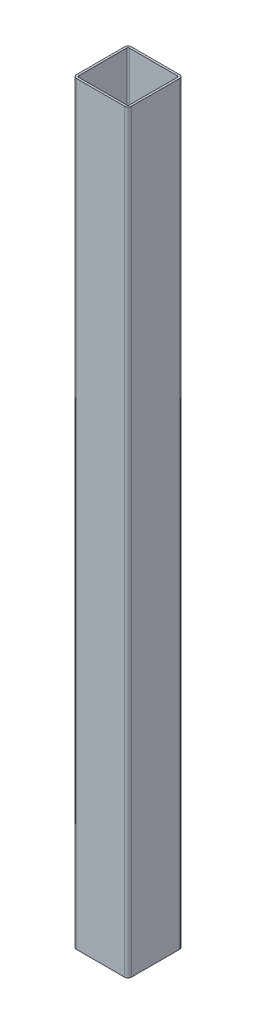
ISO-10303-21;
HEADER;
FILE_DESCRIPTION(('STEP AP214'),'2;1');
FILE_NAME('part.step','',(''),(''),'','','');
FILE_SCHEMA(('AUTOMOTIVE_DESIGN { 1 0 10303 214 1 1 1 1 }'));
ENDSEC;
DATA;
#1=APPLICATION_CONTEXT('core data for automotive mechanical design processes');
#2=APPLICATION_PROTOCOL_DEFINITION('international standard','automotive_design',2000,#1);
#3=PRODUCT_CONTEXT('',#1,'mechanical');
#4=PRODUCT('Part','Part','',(#3));
#5=PRODUCT_RELATED_PRODUCT_CATEGORY('part','',(#4));
#6=PRODUCT_DEFINITION_FORMATION('','',#4);
#7=PRODUCT_DEFINITION_CONTEXT('part definition',#1,'design');
#8=PRODUCT_DEFINITION('design','',#6,#7);
#9=PRODUCT_DEFINITION_SHAPE('','',#8);
#10=(LENGTH_UNIT() NAMED_UNIT(*) SI_UNIT(.MILLI.,.METRE.));
#11=(NAMED_UNIT(*) PLANE_ANGLE_UNIT() SI_UNIT($,.RADIAN.));
#12=(NAMED_UNIT(*) SI_UNIT($,.STERADIAN.) SOLID_ANGLE_UNIT());
#13=UNCERTAINTY_MEASURE_WITH_UNIT(LENGTH_MEASURE(1.E-05),#10,'distance_accuracy_value','');
#14=(GEOMETRIC_REPRESENTATION_CONTEXT(3) GLOBAL_UNCERTAINTY_ASSIGNED_CONTEXT((#13)) GLOBAL_UNIT_ASSIGNED_CONTEXT((#10,
#11,#12)) REPRESENTATION_CONTEXT('',''));
#15=CARTESIAN_POINT('',(0.,0.,0.));
#16=DIRECTION('',(0.,0.,1.));
#17=DIRECTION('',(1.,0.,0.));
#18=AXIS2_PLACEMENT_3D('',#15,#16,#17);
#19=CARTESIAN_POINT('',(-35.,1100.,35.));
#20=DIRECTION('',(0.,1.,0.));
#21=DIRECTION('',(0.,0.,1.));
#22=AXIS2_PLACEMENT_3D('',#19,#20,#21);
#23=PLANE('',#22);
#24=CARTESIAN_POINT('',(-35.,1100.,35.));
#25=DIRECTION('',(0.,1.,0.));
#26=DIRECTION('',(0.,0.,1.));
#27=AXIS2_PLACEMENT_3D('',#24,#25,#26);
#28=CIRCLE('',#27,5.);
#29=CARTESIAN_POINT('',(-40.,1100.,35.));
#30=VERTEX_POINT('',#29);
#31=CARTESIAN_POINT('',(-35.,1100.,40.));
#32=VERTEX_POINT('',#31);
#33=EDGE_CURVE('E261',#30,#32,#28,.T.);
#34=ORIENTED_EDGE('',*,*,#33,.T.);
#35=DIRECTION('',(1.,0.,0.));
#36=VECTOR('',#35,1.);
#37=CARTESIAN_POINT('',(-35.,1100.,40.));
#38=LINE('',#37,#36);
#39=CARTESIAN_POINT('',(35.,1100.,40.));
#40=VERTEX_POINT('',#39);
#41=EDGE_CURVE('E264',#32,#40,#38,.T.);
#42=ORIENTED_EDGE('',*,*,#41,.T.);
#43=CARTESIAN_POINT('',(35.,1100.,35.));
#44=DIRECTION('',(0.,1.,0.));
#45=DIRECTION('',(0.,0.,1.));
#46=AXIS2_PLACEMENT_3D('',#43,#44,#45);
#47=CIRCLE('',#46,5.);
#48=CARTESIAN_POINT('',(40.,1100.,35.));
#49=VERTEX_POINT('',#48);
#50=EDGE_CURVE('E267',#40,#49,#47,.T.);
#51=ORIENTED_EDGE('',*,*,#50,.T.);
#52=DIRECTION('',(0.,0.,-1.));
#53=VECTOR('',#52,1.);
#54=CARTESIAN_POINT('',(40.,1100.,-35.));
#55=LINE('',#54,#53);
#56=CARTESIAN_POINT('',(40.,1100.,-35.));
#57=VERTEX_POINT('',#56);
#58=EDGE_CURVE('E269',#49,#57,#55,.T.);
#59=ORIENTED_EDGE('',*,*,#58,.T.);
#60=CARTESIAN_POINT('',(35.,1100.,-35.));
#61=DIRECTION('',(0.,1.,0.));
#62=DIRECTION('',(0.,0.,-1.));
#63=AXIS2_PLACEMENT_3D('',#60,#61,#62);
#64=CIRCLE('',#63,5.);
#65=CARTESIAN_POINT('',(35.,1100.,-40.));
#66=VERTEX_POINT('',#65);
#67=EDGE_CURVE('E271',#57,#66,#64,.T.);
#68=ORIENTED_EDGE('',*,*,#67,.T.);
#69=DIRECTION('',(-1.,0.,0.));
#70=VECTOR('',#69,1.);
#71=CARTESIAN_POINT('',(-35.,1100.,-40.));
#72=LINE('',#71,#70);
#73=CARTESIAN_POINT('',(-35.,1100.,-40.));
#74=VERTEX_POINT('',#73);
#75=EDGE_CURVE('E273',#66,#74,#72,.T.);
#76=ORIENTED_EDGE('',*,*,#75,.T.);
#77=CARTESIAN_POINT('',(-35.,1100.,-35.));
#78=DIRECTION('',(0.,1.,0.));
#79=DIRECTION('',(0.,0.,1.));
#80=AXIS2_PLACEMENT_3D('',#77,#78,#79);
#81=CIRCLE('',#80,5.);
#82=CARTESIAN_POINT('',(-40.,1100.,-35.));
#83=VERTEX_POINT('',#82);
#84=EDGE_CURVE('E275',#74,#83,#81,.T.);
#85=ORIENTED_EDGE('',*,*,#84,.T.);
#86=DIRECTION('',(0.,0.,1.));
#87=VECTOR('',#86,1.);
#88=CARTESIAN_POINT('',(-40.,1100.,-35.));
#89=LINE('',#88,#87);
#90=EDGE_CURVE('E277',#83,#30,#89,.T.);
#91=ORIENTED_EDGE('',*,*,#90,.T.);
#92=EDGE_LOOP('',(#34,#42,#51,#59,#68,#76,#85,#91));
#93=FACE_BOUND('',#92,.T.);
#94=DIRECTION('',(1.,0.,0.));
#95=VECTOR('',#94,1.);
#96=CARTESIAN_POINT('',(-35.,1100.,37.));
#97=LINE('',#96,#95);
#98=CARTESIAN_POINT('',(-35.,1100.,37.));
#99=VERTEX_POINT('',#98);
#100=CARTESIAN_POINT('',(35.,1100.,37.));
#101=VERTEX_POINT('',#100);
#102=EDGE_CURVE('E204',#99,#101,#97,.T.);
#103=ORIENTED_EDGE('',*,*,#102,.F.);
#104=CARTESIAN_POINT('',(-35.,1100.,35.));
#105=DIRECTION('',(0.,1.,0.));
#106=DIRECTION('',(1.,0.,0.));
#107=AXIS2_PLACEMENT_3D('',#104,#105,#106);
#108=CIRCLE('',#107,2.);
#109=CARTESIAN_POINT('',(-37.,1100.,35.));
#110=VERTEX_POINT('',#109);
#111=EDGE_CURVE('E196',#110,#99,#108,.T.);
#112=ORIENTED_EDGE('',*,*,#111,.F.);
#113=DIRECTION('',(0.,0.,1.));
#114=VECTOR('',#113,1.);
#115=CARTESIAN_POINT('',(-37.,1100.,-35.));
#116=LINE('',#115,#114);
#117=CARTESIAN_POINT('',(-37.,1100.,-35.));
#118=VERTEX_POINT('',#117);
#119=EDGE_CURVE('E229',#118,#110,#116,.T.);
#120=ORIENTED_EDGE('',*,*,#119,.F.);
#121=CARTESIAN_POINT('',(-35.,1100.,-35.));
#122=DIRECTION('',(0.,1.,0.));
#123=DIRECTION('',(1.,0.,0.));
#124=AXIS2_PLACEMENT_3D('',#121,#122,#123);
#125=CIRCLE('',#124,2.);
#126=CARTESIAN_POINT('',(-35.,1100.,-37.));
#127=VERTEX_POINT('',#126);
#128=EDGE_CURVE('E227',#127,#118,#125,.T.);
#129=ORIENTED_EDGE('',*,*,#128,.F.);
#130=DIRECTION('',(-1.,0.,0.));
#131=VECTOR('',#130,1.);
#132=CARTESIAN_POINT('',(-35.,1100.,-37.));
#133=LINE('',#132,#131);
#134=CARTESIAN_POINT('',(35.,1100.,-37.));
#135=VERTEX_POINT('',#134);
#136=EDGE_CURVE('E225',#135,#127,#133,.T.);
#137=ORIENTED_EDGE('',*,*,#136,.F.);
#138=CARTESIAN_POINT('',(35.,1100.,-35.));
#139=DIRECTION('',(0.,1.,0.));
#140=DIRECTION('',(1.,0.,0.));
#141=AXIS2_PLACEMENT_3D('',#138,#139,#140);
#142=CIRCLE('',#141,2.);
#143=CARTESIAN_POINT('',(37.,1100.,-35.));
#144=VERTEX_POINT('',#143);
#145=EDGE_CURVE('E223',#144,#135,#142,.T.);
#146=ORIENTED_EDGE('',*,*,#145,.F.);
#147=DIRECTION('',(0.,0.,-1.));
#148=VECTOR('',#147,1.);
#149=CARTESIAN_POINT('',(37.,1100.,-35.));
#150=LINE('',#149,#148);
#151=CARTESIAN_POINT('',(37.,1100.,35.));
#152=VERTEX_POINT('',#151);
#153=EDGE_CURVE('E219',#152,#144,#150,.T.);
#154=ORIENTED_EDGE('',*,*,#153,.F.);
#155=CARTESIAN_POINT('',(35.,1100.,35.));
#156=DIRECTION('',(0.,1.,0.));
#157=DIRECTION('',(1.,0.,0.));
#158=AXIS2_PLACEMENT_3D('',#155,#156,#157);
#159=CIRCLE('',#158,2.);
#160=EDGE_CURVE('E217',#101,#152,#159,.T.);
#161=ORIENTED_EDGE('',*,*,#160,.F.);
#162=EDGE_LOOP('',(#103,#112,#120,#129,#137,#146,#154,#161));
#163=FACE_BOUND('',#162,.T.);
#164=ADVANCED_FACE('F83',(#93,#163),#23,.T.);
#165=CARTESIAN_POINT('',(-35.,0.,35.));
#166=DIRECTION('',(0.,1.,0.));
#167=DIRECTION('',(0.,0.,1.));
#168=AXIS2_PLACEMENT_3D('',#165,#166,#167);
#169=PLANE('',#168);
#170=CARTESIAN_POINT('',(-35.,0.,35.));
#171=DIRECTION('',(0.,1.,0.));
#172=DIRECTION('',(0.,0.,1.));
#173=AXIS2_PLACEMENT_3D('',#170,#171,#172);
#174=CIRCLE('',#173,5.);
#175=CARTESIAN_POINT('',(-40.,0.,35.));
#176=VERTEX_POINT('',#175);
#177=CARTESIAN_POINT('',(-35.,0.,40.));
#178=VERTEX_POINT('',#177);
#179=EDGE_CURVE('E212',#176,#178,#174,.T.);
#180=ORIENTED_EDGE('',*,*,#179,.F.);
#181=DIRECTION('',(0.,0.,1.));
#182=VECTOR('',#181,1.);
#183=CARTESIAN_POINT('',(-40.,0.,-35.));
#184=LINE('',#183,#182);
#185=CARTESIAN_POINT('',(-40.,0.,-35.));
#186=VERTEX_POINT('',#185);
#187=EDGE_CURVE('E265',#186,#176,#184,.T.);
#188=ORIENTED_EDGE('',*,*,#187,.F.);
#189=CARTESIAN_POINT('',(-35.,0.,-35.));
#190=DIRECTION('',(0.,1.,0.));
#191=DIRECTION('',(0.,0.,1.));
#192=AXIS2_PLACEMENT_3D('',#189,#190,#191);
#193=CIRCLE('',#192,5.);
#194=CARTESIAN_POINT('',(-35.,0.,-40.));
#195=VERTEX_POINT('',#194);
#196=EDGE_CURVE('E292',#195,#186,#193,.T.);
#197=ORIENTED_EDGE('',*,*,#196,.F.);
#198=DIRECTION('',(-1.,0.,0.));
#199=VECTOR('',#198,1.);
#200=CARTESIAN_POINT('',(-35.,0.,-40.));
#201=LINE('',#200,#199);
#202=CARTESIAN_POINT('',(35.,0.,-40.));
#203=VERTEX_POINT('',#202);
#204=EDGE_CURVE('E290',#203,#195,#201,.T.);
#205=ORIENTED_EDGE('',*,*,#204,.F.);
#206=CARTESIAN_POINT('',(35.,0.,-35.));
#207=DIRECTION('',(0.,1.,0.));
#208=DIRECTION('',(0.,0.,-1.));
#209=AXIS2_PLACEMENT_3D('',#206,#207,#208);
#210=CIRCLE('',#209,5.);
#211=CARTESIAN_POINT('',(40.,0.,-35.));
#212=VERTEX_POINT('',#211);
#213=EDGE_CURVE('E288',#212,#203,#210,.T.);
#214=ORIENTED_EDGE('',*,*,#213,.F.);
#215=DIRECTION('',(0.,0.,-1.));
#216=VECTOR('',#215,1.);
#217=CARTESIAN_POINT('',(40.,0.,-35.));
#218=LINE('',#217,#216);
#219=CARTESIAN_POINT('',(40.,0.,35.));
#220=VERTEX_POINT('',#219);
#221=EDGE_CURVE('E286',#220,#212,#218,.T.);
#222=ORIENTED_EDGE('',*,*,#221,.F.);
#223=CARTESIAN_POINT('',(35.,0.,35.));
#224=DIRECTION('',(0.,1.,0.));
#225=DIRECTION('',(0.,0.,1.));
#226=AXIS2_PLACEMENT_3D('',#223,#224,#225);
#227=CIRCLE('',#226,5.);
#228=CARTESIAN_POINT('',(35.,0.,40.));
#229=VERTEX_POINT('',#228);
#230=EDGE_CURVE('E284',#229,#220,#227,.T.);
#231=ORIENTED_EDGE('',*,*,#230,.F.);
#232=DIRECTION('',(1.,0.,0.));
#233=VECTOR('',#232,1.);
#234=CARTESIAN_POINT('',(-35.,0.,40.));
#235=LINE('',#234,#233);
#236=EDGE_CURVE('E282',#178,#229,#235,.T.);
#237=ORIENTED_EDGE('',*,*,#236,.F.);
#238=EDGE_LOOP('',(#180,#188,#197,#205,#214,#222,#231,#237));
#239=FACE_BOUND('',#238,.T.);
#240=CARTESIAN_POINT('',(-35.,0.,35.));
#241=DIRECTION('',(0.,1.,0.));
#242=DIRECTION('',(1.,0.,0.));
#243=AXIS2_PLACEMENT_3D('',#240,#241,#242);
#244=CIRCLE('',#243,2.);
#245=CARTESIAN_POINT('',(-37.,0.,35.));
#246=VERTEX_POINT('',#245);
#247=CARTESIAN_POINT('',(-35.,0.,37.));
#248=VERTEX_POINT('',#247);
#249=EDGE_CURVE('E106',#246,#248,#244,.T.);
#250=ORIENTED_EDGE('',*,*,#249,.T.);
#251=DIRECTION('',(1.,0.,0.));
#252=VECTOR('',#251,1.);
#253=CARTESIAN_POINT('',(-35.,0.,37.));
#254=LINE('',#253,#252);
#255=CARTESIAN_POINT('',(35.,0.,37.));
#256=VERTEX_POINT('',#255);
#257=EDGE_CURVE('E211',#248,#256,#254,.T.);
#258=ORIENTED_EDGE('',*,*,#257,.T.);
#259=CARTESIAN_POINT('',(35.,0.,35.));
#260=DIRECTION('',(0.,1.,0.));
#261=DIRECTION('',(1.,0.,0.));
#262=AXIS2_PLACEMENT_3D('',#259,#260,#261);
#263=CIRCLE('',#262,2.);
#264=CARTESIAN_POINT('',(37.,0.,35.));
#265=VERTEX_POINT('',#264);
#266=EDGE_CURVE('E233',#256,#265,#263,.T.);
#267=ORIENTED_EDGE('',*,*,#266,.T.);
#268=DIRECTION('',(0.,0.,-1.));
#269=VECTOR('',#268,1.);
#270=CARTESIAN_POINT('',(37.,0.,-35.));
#271=LINE('',#270,#269);
#272=CARTESIAN_POINT('',(37.,0.,-35.));
#273=VERTEX_POINT('',#272);
#274=EDGE_CURVE('E236',#265,#273,#271,.T.);
#275=ORIENTED_EDGE('',*,*,#274,.T.);
#276=CARTESIAN_POINT('',(35.,0.,-35.));
#277=DIRECTION('',(0.,1.,0.));
#278=DIRECTION('',(1.,0.,0.));
#279=AXIS2_PLACEMENT_3D('',#276,#277,#278);
#280=CIRCLE('',#279,2.);
#281=CARTESIAN_POINT('',(35.,0.,-37.));
#282=VERTEX_POINT('',#281);
#283=EDGE_CURVE('E239',#273,#282,#280,.T.);
#284=ORIENTED_EDGE('',*,*,#283,.T.);
#285=DIRECTION('',(-1.,0.,0.));
#286=VECTOR('',#285,1.);
#287=CARTESIAN_POINT('',(-35.,0.,-37.));
#288=LINE('',#287,#286);
#289=CARTESIAN_POINT('',(-35.,0.,-37.));
#290=VERTEX_POINT('',#289);
#291=EDGE_CURVE('E242',#282,#290,#288,.T.);
#292=ORIENTED_EDGE('',*,*,#291,.T.);
#293=CARTESIAN_POINT('',(-35.,0.,-35.));
#294=DIRECTION('',(0.,1.,0.));
#295=DIRECTION('',(1.,0.,0.));
#296=AXIS2_PLACEMENT_3D('',#293,#294,#295);
#297=CIRCLE('',#296,2.);
#298=CARTESIAN_POINT('',(-37.,0.,-35.));
#299=VERTEX_POINT('',#298);
#300=EDGE_CURVE('E245',#290,#299,#297,.T.);
#301=ORIENTED_EDGE('',*,*,#300,.T.);
#302=DIRECTION('',(0.,0.,1.));
#303=VECTOR('',#302,1.);
#304=CARTESIAN_POINT('',(-37.,0.,-35.));
#305=LINE('',#304,#303);
#306=EDGE_CURVE('E205',#299,#246,#305,.T.);
#307=ORIENTED_EDGE('',*,*,#306,.T.);
#308=EDGE_LOOP('',(#250,#258,#267,#275,#284,#292,#301,#307));
#309=FACE_BOUND('',#308,.T.);
#310=ADVANCED_FACE('F322',(#239,#309),#169,.F.);
#311=CARTESIAN_POINT('',(-35.,1100.,35.));
#312=DIRECTION('',(0.,-1.,0.));
#313=DIRECTION('',(0.,0.,-1.));
#314=AXIS2_PLACEMENT_3D('',#311,#312,#313);
#315=CYLINDRICAL_SURFACE('',#314,5.);
#316=ORIENTED_EDGE('',*,*,#179,.T.);
#317=DIRECTION('',(0.,-1.,0.));
#318=VECTOR('',#317,1.);
#319=CARTESIAN_POINT('',(-35.,1100.,40.));
#320=LINE('',#319,#318);
#321=EDGE_CURVE('E12',#32,#178,#320,.T.);
#322=ORIENTED_EDGE('',*,*,#321,.F.);
#323=ORIENTED_EDGE('',*,*,#33,.F.);
#324=DIRECTION('',(0.,-1.,0.));
#325=VECTOR('',#324,1.);
#326=CARTESIAN_POINT('',(-40.,1100.,35.));
#327=LINE('',#326,#325);
#328=EDGE_CURVE('E279',#30,#176,#327,.T.);
#329=ORIENTED_EDGE('',*,*,#328,.T.);
#330=EDGE_LOOP('',(#316,#322,#323,#329));
#331=FACE_BOUND('',#330,.T.);
#332=ADVANCED_FACE('F85',(#331),#315,.T.);
#333=CARTESIAN_POINT('',(-35.,1100.,40.));
#334=DIRECTION('',(0.,0.,-1.));
#335=DIRECTION('',(-1.,0.,0.));
#336=AXIS2_PLACEMENT_3D('',#333,#334,#335);
#337=PLANE('',#336);
#338=ORIENTED_EDGE('',*,*,#236,.T.);
#339=DIRECTION('',(0.,-1.,0.));
#340=VECTOR('',#339,1.);
#341=CARTESIAN_POINT('',(35.,1100.,40.));
#342=LINE('',#341,#340);
#343=EDGE_CURVE('E91',#40,#229,#342,.T.);
#344=ORIENTED_EDGE('',*,*,#343,.F.);
#345=ORIENTED_EDGE('',*,*,#41,.F.);
#346=ORIENTED_EDGE('',*,*,#321,.T.);
#347=EDGE_LOOP('',(#338,#344,#345,#346));
#348=FACE_BOUND('',#347,.T.);
#349=ADVANCED_FACE('F339',(#348),#337,.F.);
#350=CARTESIAN_POINT('',(35.,1100.,35.));
#351=DIRECTION('',(0.,-1.,0.));
#352=DIRECTION('',(0.,0.,-1.));
#353=AXIS2_PLACEMENT_3D('',#350,#351,#352);
#354=CYLINDRICAL_SURFACE('',#353,5.);
#355=ORIENTED_EDGE('',*,*,#230,.T.);
#356=DIRECTION('',(0.,-1.,0.));
#357=VECTOR('',#356,1.);
#358=CARTESIAN_POINT('',(40.,1100.,35.));
#359=LINE('',#358,#357);
#360=EDGE_CURVE('E309',#49,#220,#359,.T.);
#361=ORIENTED_EDGE('',*,*,#360,.F.);
#362=ORIENTED_EDGE('',*,*,#50,.F.);
#363=ORIENTED_EDGE('',*,*,#343,.T.);
#364=EDGE_LOOP('',(#355,#361,#362,#363));
#365=FACE_BOUND('',#364,.T.);
#366=ADVANCED_FACE('F316',(#365),#354,.T.);
#367=CARTESIAN_POINT('',(40.,1100.,-35.));
#368=DIRECTION('',(-1.,0.,0.));
#369=DIRECTION('',(0.,0.,1.));
#370=AXIS2_PLACEMENT_3D('',#367,#368,#369);
#371=PLANE('',#370);
#372=ORIENTED_EDGE('',*,*,#221,.T.);
#373=DIRECTION('',(0.,-1.,0.));
#374=VECTOR('',#373,1.);
#375=CARTESIAN_POINT('',(40.,1100.,-35.));
#376=LINE('',#375,#374);
#377=EDGE_CURVE('E306',#57,#212,#376,.T.);
#378=ORIENTED_EDGE('',*,*,#377,.F.);
#379=ORIENTED_EDGE('',*,*,#58,.F.);
#380=ORIENTED_EDGE('',*,*,#360,.T.);
#381=EDGE_LOOP('',(#372,#378,#379,#380));
#382=FACE_BOUND('',#381,.T.);
#383=ADVANCED_FACE('F328',(#382),#371,.F.);
#384=CARTESIAN_POINT('',(35.,1100.,-35.));
#385=DIRECTION('',(0.,-1.,0.));
#386=DIRECTION('',(0.,0.,-1.));
#387=AXIS2_PLACEMENT_3D('',#384,#385,#386);
#388=CYLINDRICAL_SURFACE('',#387,5.);
#389=ORIENTED_EDGE('',*,*,#213,.T.);
#390=DIRECTION('',(0.,-1.,0.));
#391=VECTOR('',#390,1.);
#392=CARTESIAN_POINT('',(35.,1100.,-40.));
#393=LINE('',#392,#391);
#394=EDGE_CURVE('E303',#66,#203,#393,.T.);
#395=ORIENTED_EDGE('',*,*,#394,.F.);
#396=ORIENTED_EDGE('',*,*,#67,.F.);
#397=ORIENTED_EDGE('',*,*,#377,.T.);
#398=EDGE_LOOP('',(#389,#395,#396,#397));
#399=FACE_BOUND('',#398,.T.);
#400=ADVANCED_FACE('F332',(#399),#388,.T.);
#401=CARTESIAN_POINT('',(-35.,1100.,-40.));
#402=DIRECTION('',(0.,0.,1.));
#403=DIRECTION('',(1.,0.,0.));
#404=AXIS2_PLACEMENT_3D('',#401,#402,#403);
#405=PLANE('',#404);
#406=ORIENTED_EDGE('',*,*,#204,.T.);
#407=DIRECTION('',(0.,-1.,0.));
#408=VECTOR('',#407,1.);
#409=CARTESIAN_POINT('',(-35.,1100.,-40.));
#410=LINE('',#409,#408);
#411=EDGE_CURVE('E300',#74,#195,#410,.T.);
#412=ORIENTED_EDGE('',*,*,#411,.F.);
#413=ORIENTED_EDGE('',*,*,#75,.F.);
#414=ORIENTED_EDGE('',*,*,#394,.T.);
#415=EDGE_LOOP('',(#406,#412,#413,#414));
#416=FACE_BOUND('',#415,.T.);
#417=ADVANCED_FACE('F352',(#416),#405,.F.);
#418=CARTESIAN_POINT('',(-35.,1100.,-35.));
#419=DIRECTION('',(0.,-1.,0.));
#420=DIRECTION('',(0.,0.,-1.));
#421=AXIS2_PLACEMENT_3D('',#418,#419,#420);
#422=CYLINDRICAL_SURFACE('',#421,5.);
#423=ORIENTED_EDGE('',*,*,#196,.T.);
#424=DIRECTION('',(0.,-1.,0.));
#425=VECTOR('',#424,1.);
#426=CARTESIAN_POINT('',(-40.,1100.,-35.));
#427=LINE('',#426,#425);
#428=EDGE_CURVE('E297',#83,#186,#427,.T.);
#429=ORIENTED_EDGE('',*,*,#428,.F.);
#430=ORIENTED_EDGE('',*,*,#84,.F.);
#431=ORIENTED_EDGE('',*,*,#411,.T.);
#432=EDGE_LOOP('',(#423,#429,#430,#431));
#433=FACE_BOUND('',#432,.T.);
#434=ADVANCED_FACE('F350',(#433),#422,.T.);
#435=CARTESIAN_POINT('',(-40.,1100.,-35.));
#436=DIRECTION('',(1.,0.,0.));
#437=DIRECTION('',(0.,0.,-1.));
#438=AXIS2_PLACEMENT_3D('',#435,#436,#437);
#439=PLANE('',#438);
#440=ORIENTED_EDGE('',*,*,#187,.T.);
#441=ORIENTED_EDGE('',*,*,#328,.F.);
#442=ORIENTED_EDGE('',*,*,#90,.F.);
#443=ORIENTED_EDGE('',*,*,#428,.T.);
#444=EDGE_LOOP('',(#440,#441,#442,#443));
#445=FACE_BOUND('',#444,.T.);
#446=ADVANCED_FACE('F345',(#445),#439,.F.);
#447=CARTESIAN_POINT('',(-35.,1100.,35.));
#448=DIRECTION('',(0.,-1.,0.));
#449=DIRECTION('',(0.,0.,-1.));
#450=AXIS2_PLACEMENT_3D('',#447,#448,#449);
#451=CYLINDRICAL_SURFACE('',#450,2.);
#452=ORIENTED_EDGE('',*,*,#249,.F.);
#453=DIRECTION('',(0.,-1.,0.));
#454=VECTOR('',#453,1.);
#455=CARTESIAN_POINT('',(-37.,1100.,35.));
#456=LINE('',#455,#454);
#457=EDGE_CURVE('E200',#110,#246,#456,.T.);
#458=ORIENTED_EDGE('',*,*,#457,.F.);
#459=ORIENTED_EDGE('',*,*,#111,.T.);
#460=DIRECTION('',(0.,-1.,0.));
#461=VECTOR('',#460,1.);
#462=CARTESIAN_POINT('',(-35.,1100.,37.));
#463=LINE('',#462,#461);
#464=EDGE_CURVE('E199',#99,#248,#463,.T.);
#465=ORIENTED_EDGE('',*,*,#464,.T.);
#466=EDGE_LOOP('',(#452,#458,#459,#465));
#467=FACE_BOUND('',#466,.T.);
#468=ADVANCED_FACE('F198',(#467),#451,.F.);
#469=CARTESIAN_POINT('',(-35.,1100.,37.));
#470=DIRECTION('',(0.,0.,-1.));
#471=DIRECTION('',(-1.,0.,0.));
#472=AXIS2_PLACEMENT_3D('',#469,#470,#471);
#473=PLANE('',#472);
#474=ORIENTED_EDGE('',*,*,#257,.F.);
#475=ORIENTED_EDGE('',*,*,#464,.F.);
#476=ORIENTED_EDGE('',*,*,#102,.T.);
#477=DIRECTION('',(0.,-1.,0.));
#478=VECTOR('',#477,1.);
#479=CARTESIAN_POINT('',(35.,1100.,37.));
#480=LINE('',#479,#478);
#481=EDGE_CURVE('E213',#101,#256,#480,.T.);
#482=ORIENTED_EDGE('',*,*,#481,.T.);
#483=EDGE_LOOP('',(#474,#475,#476,#482));
#484=FACE_BOUND('',#483,.T.);
#485=ADVANCED_FACE('F208',(#484),#473,.T.);
#486=CARTESIAN_POINT('',(35.,1100.,35.));
#487=DIRECTION('',(0.,-1.,0.));
#488=DIRECTION('',(0.,0.,-1.));
#489=AXIS2_PLACEMENT_3D('',#486,#487,#488);
#490=CYLINDRICAL_SURFACE('',#489,2.);
#491=ORIENTED_EDGE('',*,*,#266,.F.);
#492=ORIENTED_EDGE('',*,*,#481,.F.);
#493=ORIENTED_EDGE('',*,*,#160,.T.);
#494=DIRECTION('',(0.,-1.,0.));
#495=VECTOR('',#494,1.);
#496=CARTESIAN_POINT('',(37.,1100.,35.));
#497=LINE('',#496,#495);
#498=EDGE_CURVE('E258',#152,#265,#497,.T.);
#499=ORIENTED_EDGE('',*,*,#498,.T.);
#500=EDGE_LOOP('',(#491,#492,#493,#499));
#501=FACE_BOUND('',#500,.T.);
#502=ADVANCED_FACE('F377',(#501),#490,.F.);
#503=CARTESIAN_POINT('',(37.,1100.,-35.));
#504=DIRECTION('',(-1.,0.,0.));
#505=DIRECTION('',(0.,0.,1.));
#506=AXIS2_PLACEMENT_3D('',#503,#504,#505);
#507=PLANE('',#506);
#508=ORIENTED_EDGE('',*,*,#274,.F.);
#509=ORIENTED_EDGE('',*,*,#498,.F.);
#510=ORIENTED_EDGE('',*,*,#153,.T.);
#511=DIRECTION('',(0.,-1.,0.));
#512=VECTOR('',#511,1.);
#513=CARTESIAN_POINT('',(37.,1100.,-35.));
#514=LINE('',#513,#512);
#515=EDGE_CURVE('E256',#144,#273,#514,.T.);
#516=ORIENTED_EDGE('',*,*,#515,.T.);
#517=EDGE_LOOP('',(#508,#509,#510,#516));
#518=FACE_BOUND('',#517,.T.);
#519=ADVANCED_FACE('F381',(#518),#507,.T.);
#520=CARTESIAN_POINT('',(35.,1100.,-35.));
#521=DIRECTION('',(0.,-1.,0.));
#522=DIRECTION('',(0.,0.,-1.));
#523=AXIS2_PLACEMENT_3D('',#520,#521,#522);
#524=CYLINDRICAL_SURFACE('',#523,2.);
#525=ORIENTED_EDGE('',*,*,#283,.F.);
#526=ORIENTED_EDGE('',*,*,#515,.F.);
#527=ORIENTED_EDGE('',*,*,#145,.T.);
#528=DIRECTION('',(0.,-1.,0.));
#529=VECTOR('',#528,1.);
#530=CARTESIAN_POINT('',(35.,1100.,-37.));
#531=LINE('',#530,#529);
#532=EDGE_CURVE('E254',#135,#282,#531,.T.);
#533=ORIENTED_EDGE('',*,*,#532,.T.);
#534=EDGE_LOOP('',(#525,#526,#527,#533));
#535=FACE_BOUND('',#534,.T.);
#536=ADVANCED_FACE('F387',(#535),#524,.F.);
#537=CARTESIAN_POINT('',(-35.,1100.,-37.));
#538=DIRECTION('',(0.,0.,1.));
#539=DIRECTION('',(1.,0.,0.));
#540=AXIS2_PLACEMENT_3D('',#537,#538,#539);
#541=PLANE('',#540);
#542=ORIENTED_EDGE('',*,*,#291,.F.);
#543=ORIENTED_EDGE('',*,*,#532,.F.);
#544=ORIENTED_EDGE('',*,*,#136,.T.);
#545=DIRECTION('',(0.,-1.,0.));
#546=VECTOR('',#545,1.);
#547=CARTESIAN_POINT('',(-35.,1100.,-37.));
#548=LINE('',#547,#546);
#549=EDGE_CURVE('E252',#127,#290,#548,.T.);
#550=ORIENTED_EDGE('',*,*,#549,.T.);
#551=EDGE_LOOP('',(#542,#543,#544,#550));
#552=FACE_BOUND('',#551,.T.);
#553=ADVANCED_FACE('F391',(#552),#541,.T.);
#554=CARTESIAN_POINT('',(-35.,1100.,-35.));
#555=DIRECTION('',(0.,-1.,0.));
#556=DIRECTION('',(0.,0.,-1.));
#557=AXIS2_PLACEMENT_3D('',#554,#555,#556);
#558=CYLINDRICAL_SURFACE('',#557,2.);
#559=ORIENTED_EDGE('',*,*,#300,.F.);
#560=ORIENTED_EDGE('',*,*,#549,.F.);
#561=ORIENTED_EDGE('',*,*,#128,.T.);
#562=DIRECTION('',(0.,-1.,0.));
#563=VECTOR('',#562,1.);
#564=CARTESIAN_POINT('',(-37.,1100.,-35.));
#565=LINE('',#564,#563);
#566=EDGE_CURVE('E98',#118,#299,#565,.T.);
#567=ORIENTED_EDGE('',*,*,#566,.T.);
#568=EDGE_LOOP('',(#559,#560,#561,#567));
#569=FACE_BOUND('',#568,.T.);
#570=ADVANCED_FACE('F395',(#569),#558,.F.);
#571=CARTESIAN_POINT('',(-37.,1100.,-35.));
#572=DIRECTION('',(1.,0.,0.));
#573=DIRECTION('',(0.,0.,-1.));
#574=AXIS2_PLACEMENT_3D('',#571,#572,#573);
#575=PLANE('',#574);
#576=ORIENTED_EDGE('',*,*,#306,.F.);
#577=ORIENTED_EDGE('',*,*,#566,.F.);
#578=ORIENTED_EDGE('',*,*,#119,.T.);
#579=ORIENTED_EDGE('',*,*,#457,.T.);
#580=EDGE_LOOP('',(#576,#577,#578,#579));
#581=FACE_BOUND('',#580,.T.);
#582=ADVANCED_FACE('F399',(#581),#575,.T.);
#583=CLOSED_SHELL('',(#164,#310,#332,#349,#366,#383,#400,#417,#434,#446,#468,#485,#502,#519,
#536,#553,#570,#582));
#584=MANIFOLD_SOLID_BREP('B2',#583);
#585=ADVANCED_BREP_SHAPE_REPRESENTATION('',(#18,#584),#14);
#586=SHAPE_DEFINITION_REPRESENTATION(#9,#585);
ENDSEC;
END-ISO-10303-21;
